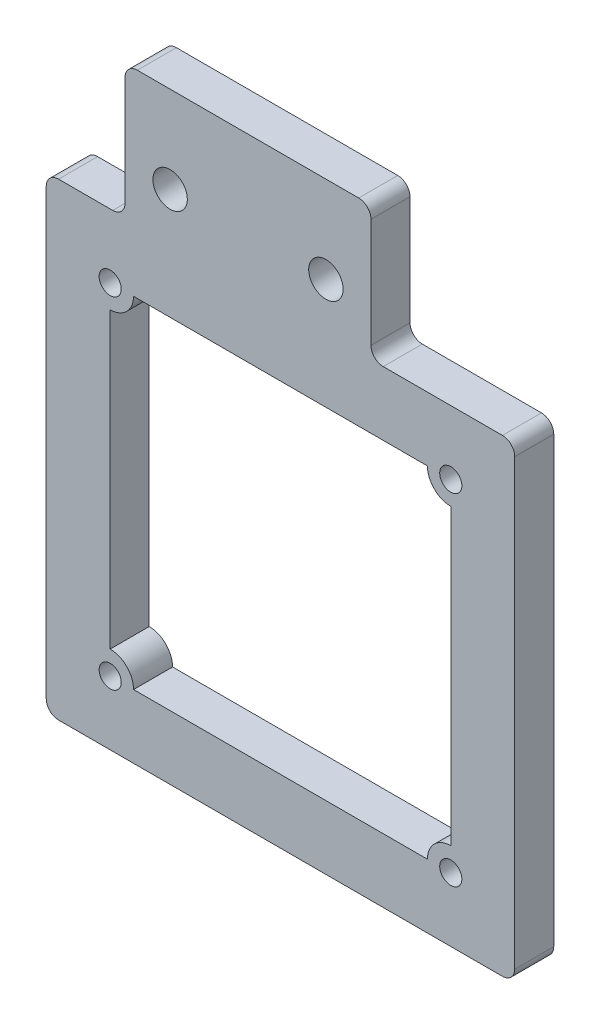
ISO-10303-21;
HEADER;
FILE_DESCRIPTION(('STEP AP214'),'2;1');
FILE_NAME('part.step','',(''),(''),'','','');
FILE_SCHEMA(('AUTOMOTIVE_DESIGN { 1 0 10303 214 1 1 1 1 }'));
ENDSEC;
DATA;
#1=APPLICATION_CONTEXT('core data for automotive mechanical design processes');
#2=APPLICATION_PROTOCOL_DEFINITION('international standard','automotive_design',2000,#1);
#3=PRODUCT_CONTEXT('',#1,'mechanical');
#4=PRODUCT('Part','Part','',(#3));
#5=PRODUCT_RELATED_PRODUCT_CATEGORY('part','',(#4));
#6=PRODUCT_DEFINITION_FORMATION('','',#4);
#7=PRODUCT_DEFINITION_CONTEXT('part definition',#1,'design');
#8=PRODUCT_DEFINITION('design','',#6,#7);
#9=PRODUCT_DEFINITION_SHAPE('','',#8);
#10=(LENGTH_UNIT() NAMED_UNIT(*) SI_UNIT(.MILLI.,.METRE.));
#11=(NAMED_UNIT(*) PLANE_ANGLE_UNIT() SI_UNIT($,.RADIAN.));
#12=(NAMED_UNIT(*) SI_UNIT($,.STERADIAN.) SOLID_ANGLE_UNIT());
#13=UNCERTAINTY_MEASURE_WITH_UNIT(LENGTH_MEASURE(1.E-05),#10,'distance_accuracy_value','');
#14=(GEOMETRIC_REPRESENTATION_CONTEXT(3) GLOBAL_UNCERTAINTY_ASSIGNED_CONTEXT((#13)) GLOBAL_UNIT_ASSIGNED_CONTEXT((#10,
#11,#12)) REPRESENTATION_CONTEXT('',''));
#15=CARTESIAN_POINT('',(0.,0.,0.));
#16=DIRECTION('',(0.,0.,1.));
#17=DIRECTION('',(1.,0.,0.));
#18=AXIS2_PLACEMENT_3D('',#15,#16,#17);
#19=CARTESIAN_POINT('',(0.,0.,3.175));
#20=DIRECTION('',(0.,0.,1.));
#21=DIRECTION('',(1.,0.,0.));
#22=AXIS2_PLACEMENT_3D('',#19,#20,#21);
#23=PLANE('',#22);
#24=CARTESIAN_POINT('',(-1.20910547078258,-5.19999999999999,3.175));
#25=DIRECTION('',(0.,0.,1.));
#26=DIRECTION('',(1.,0.,0.));
#27=AXIS2_PLACEMENT_3D('',#24,#25,#26);
#28=CIRCLE('',#27,0.9);
#29=CARTESIAN_POINT('',(-0.309105470782583,-5.19999999999999,3.175));
#30=VERTEX_POINT('',#29);
#31=EDGE_CURVE('E907',#30,#30,#28,.T.);
#32=ORIENTED_EDGE('',*,*,#31,.F.);
#33=EDGE_LOOP('',(#32));
#34=FACE_BOUND('',#33,.T.);
#35=CARTESIAN_POINT('',(3.66495523115076,3.81159322250824,3.175));
#36=DIRECTION('',(0.,0.,1.));
#37=DIRECTION('',(1.,0.,0.));
#38=AXIS2_PLACEMENT_3D('',#35,#36,#37);
#39=CIRCLE('',#38,1.4);
#40=CARTESIAN_POINT('',(5.06495523115076,3.81159322250824,3.175));
#41=VERTEX_POINT('',#40);
#42=EDGE_CURVE('E592',#41,#41,#39,.T.);
#43=ORIENTED_EDGE('',*,*,#42,.F.);
#44=EDGE_LOOP('',(#43));
#45=FACE_BOUND('',#44,.T.);
#46=CARTESIAN_POINT('',(-1.20910547078258,-32.9,3.175));
#47=DIRECTION('',(0.,0.,1.));
#48=DIRECTION('',(1.,0.,0.));
#49=AXIS2_PLACEMENT_3D('',#46,#47,#48);
#50=CIRCLE('',#49,0.899999999999999);
#51=CARTESIAN_POINT('',(-0.309105470782584,-32.9,3.175));
#52=VERTEX_POINT('',#51);
#53=EDGE_CURVE('E604',#52,#52,#50,.T.);
#54=ORIENTED_EDGE('',*,*,#53,.F.);
#55=EDGE_LOOP('',(#54));
#56=FACE_BOUND('',#55,.T.);
#57=DIRECTION('',(0.,-1.,0.));
#58=VECTOR('',#57,1.);
#59=CARTESIAN_POINT('',(20.,10.8755385296888,3.175));
#60=LINE('',#59,#58);
#61=CARTESIAN_POINT('',(20.,9.87553852968881,3.175));
#62=VERTEX_POINT('',#61);
#63=CARTESIAN_POINT('',(20.,1.,3.175));
#64=VERTEX_POINT('',#63);
#65=EDGE_CURVE('E630',#62,#64,#60,.T.);
#66=ORIENTED_EDGE('',*,*,#65,.F.);
#67=CARTESIAN_POINT('',(19.,9.87553852968881,3.175));
#68=DIRECTION('',(0.,0.,1.));
#69=DIRECTION('',(1.,0.,0.));
#70=AXIS2_PLACEMENT_3D('',#67,#68,#69);
#71=CIRCLE('',#70,1.);
#72=CARTESIAN_POINT('',(19.,10.8755385296888,3.175));
#73=VERTEX_POINT('',#72);
#74=EDGE_CURVE('E690',#62,#73,#71,.T.);
#75=ORIENTED_EDGE('',*,*,#74,.T.);
#76=DIRECTION('',(-1.,0.,0.));
#77=VECTOR('',#76,1.);
#78=CARTESIAN_POINT('',(20.,10.8755385296888,3.175));
#79=LINE('',#78,#77);
#80=CARTESIAN_POINT('',(1.,10.8755385296888,3.175));
#81=VERTEX_POINT('',#80);
#82=EDGE_CURVE('E610',#73,#81,#79,.T.);
#83=ORIENTED_EDGE('',*,*,#82,.T.);
#84=CARTESIAN_POINT('',(1.,9.87553852968881,3.175));
#85=DIRECTION('',(0.,0.,1.));
#86=DIRECTION('',(1.,0.,0.));
#87=AXIS2_PLACEMENT_3D('',#84,#85,#86);
#88=CIRCLE('',#87,1.);
#89=CARTESIAN_POINT('',(0.,9.87553852968881,3.175));
#90=VERTEX_POINT('',#89);
#91=EDGE_CURVE('E688',#81,#90,#88,.T.);
#92=ORIENTED_EDGE('',*,*,#91,.T.);
#93=DIRECTION('',(0.,-1.,0.));
#94=VECTOR('',#93,1.);
#95=CARTESIAN_POINT('',(0.,10.8755385296888,3.175));
#96=LINE('',#95,#94);
#97=CARTESIAN_POINT('',(0.,1.,3.175));
#98=VERTEX_POINT('',#97);
#99=EDGE_CURVE('E613',#90,#98,#96,.T.);
#100=ORIENTED_EDGE('',*,*,#99,.T.);
#101=CARTESIAN_POINT('',(-1.,1.,3.175));
#102=DIRECTION('',(0.,0.,1.));
#103=DIRECTION('',(1.,0.,0.));
#104=AXIS2_PLACEMENT_3D('',#101,#102,#103);
#105=CIRCLE('',#104,1.);
#106=CARTESIAN_POINT('',(-1.,0.,3.175));
#107=VERTEX_POINT('',#106);
#108=EDGE_CURVE('E12',#98,#107,#105,.F.);
#109=ORIENTED_EDGE('',*,*,#108,.T.);
#110=DIRECTION('',(-1.,0.,0.));
#111=VECTOR('',#110,1.);
#112=CARTESIAN_POINT('',(0.,0.,3.175));
#113=LINE('',#112,#111);
#114=CARTESIAN_POINT('',(-5.40910547078259,0.,3.175));
#115=VERTEX_POINT('',#114);
#116=EDGE_CURVE('E617',#107,#115,#113,.T.);
#117=ORIENTED_EDGE('',*,*,#116,.T.);
#118=CARTESIAN_POINT('',(-5.40910547078259,-0.999999999999994,3.175));
#119=DIRECTION('',(0.,0.,1.));
#120=DIRECTION('',(1.,0.,0.));
#121=AXIS2_PLACEMENT_3D('',#118,#119,#120);
#122=CIRCLE('',#121,1.);
#123=CARTESIAN_POINT('',(-6.40910547078259,-0.999999999999994,3.175));
#124=VERTEX_POINT('',#123);
#125=EDGE_CURVE('E686',#115,#124,#122,.T.);
#126=ORIENTED_EDGE('',*,*,#125,.T.);
#127=DIRECTION('',(0.,-1.,0.));
#128=VECTOR('',#127,1.);
#129=CARTESIAN_POINT('',(-6.40910547078259,0.,3.175));
#130=LINE('',#129,#128);
#131=CARTESIAN_POINT('',(-6.40910547078259,-37.1,3.175));
#132=VERTEX_POINT('',#131);
#133=EDGE_CURVE('E620',#124,#132,#130,.T.);
#134=ORIENTED_EDGE('',*,*,#133,.T.);
#135=CARTESIAN_POINT('',(-5.40910547078259,-37.1,3.175));
#136=DIRECTION('',(0.,0.,1.));
#137=DIRECTION('',(1.,0.,0.));
#138=AXIS2_PLACEMENT_3D('',#135,#136,#137);
#139=CIRCLE('',#138,1.);
#140=CARTESIAN_POINT('',(-5.40910547078259,-38.1,3.175));
#141=VERTEX_POINT('',#140);
#142=EDGE_CURVE('E684',#132,#141,#139,.T.);
#143=ORIENTED_EDGE('',*,*,#142,.T.);
#144=DIRECTION('',(1.,0.,0.));
#145=VECTOR('',#144,1.);
#146=CARTESIAN_POINT('',(-6.40910547078259,-38.1,3.175));
#147=LINE('',#146,#145);
#148=CARTESIAN_POINT('',(30.6908945292174,-38.1,3.175));
#149=VERTEX_POINT('',#148);
#150=EDGE_CURVE('E623',#141,#149,#147,.T.);
#151=ORIENTED_EDGE('',*,*,#150,.T.);
#152=CARTESIAN_POINT('',(30.6908945292174,-37.1,3.175));
#153=DIRECTION('',(0.,0.,1.));
#154=DIRECTION('',(1.,0.,0.));
#155=AXIS2_PLACEMENT_3D('',#152,#153,#154);
#156=CIRCLE('',#155,1.);
#157=CARTESIAN_POINT('',(31.6908945292174,-37.1,3.175));
#158=VERTEX_POINT('',#157);
#159=EDGE_CURVE('E374',#149,#158,#156,.T.);
#160=ORIENTED_EDGE('',*,*,#159,.T.);
#161=DIRECTION('',(0.,1.,0.));
#162=VECTOR('',#161,1.);
#163=CARTESIAN_POINT('',(31.6908945292174,-38.1,3.175));
#164=LINE('',#163,#162);
#165=CARTESIAN_POINT('',(31.6908945292174,-0.999999999999987,3.175));
#166=VERTEX_POINT('',#165);
#167=EDGE_CURVE('E625',#158,#166,#164,.T.);
#168=ORIENTED_EDGE('',*,*,#167,.T.);
#169=CARTESIAN_POINT('',(30.6908945292174,-0.99999999999999,3.175));
#170=DIRECTION('',(0.,0.,1.));
#171=DIRECTION('',(1.,0.,0.));
#172=AXIS2_PLACEMENT_3D('',#169,#170,#171);
#173=CIRCLE('',#172,1.);
#174=CARTESIAN_POINT('',(30.6908945292174,0.,3.175));
#175=VERTEX_POINT('',#174);
#176=EDGE_CURVE('E682',#166,#175,#173,.T.);
#177=ORIENTED_EDGE('',*,*,#176,.T.);
#178=DIRECTION('',(-1.,0.,0.));
#179=VECTOR('',#178,1.);
#180=CARTESIAN_POINT('',(31.6908945292174,0.,3.175));
#181=LINE('',#180,#179);
#182=CARTESIAN_POINT('',(21.,0.,3.175));
#183=VERTEX_POINT('',#182);
#184=EDGE_CURVE('E627',#175,#183,#181,.T.);
#185=ORIENTED_EDGE('',*,*,#184,.T.);
#186=CARTESIAN_POINT('',(21.,1.,3.175));
#187=DIRECTION('',(0.,0.,1.));
#188=DIRECTION('',(1.,0.,0.));
#189=AXIS2_PLACEMENT_3D('',#186,#187,#188);
#190=CIRCLE('',#189,1.);
#191=EDGE_CURVE('E718',#183,#64,#190,.F.);
#192=ORIENTED_EDGE('',*,*,#191,.T.);
#193=EDGE_LOOP('',(#66,#75,#83,#92,#100,#109,#117,#126,#134,#143,#151,#160,#168,#177,#185,#192));
#194=FACE_BOUND('',#193,.T.);
#195=CARTESIAN_POINT('',(26.4908945292174,-32.9,3.175));
#196=DIRECTION('',(0.,0.,1.));
#197=DIRECTION('',(1.,0.,0.));
#198=AXIS2_PLACEMENT_3D('',#195,#196,#197);
#199=CIRCLE('',#198,0.9);
#200=CARTESIAN_POINT('',(27.3908945292174,-32.9,3.175));
#201=VERTEX_POINT('',#200);
#202=EDGE_CURVE('E598',#201,#201,#199,.T.);
#203=ORIENTED_EDGE('',*,*,#202,.F.);
#204=EDGE_LOOP('',(#203));
#205=FACE_BOUND('',#204,.T.);
#206=CARTESIAN_POINT('',(-1.20910547078258,-5.19999999999999,3.175));
#207=DIRECTION('',(0.,0.,1.));
#208=DIRECTION('',(1.,0.,0.));
#209=AXIS2_PLACEMENT_3D('',#206,#207,#208);
#210=CIRCLE('',#209,1.9);
#211=CARTESIAN_POINT('',(-1.20910547078258,-7.09999999999999,3.175));
#212=VERTEX_POINT('',#211);
#213=CARTESIAN_POINT('',(0.690894529217419,-5.19999999999999,3.175));
#214=VERTEX_POINT('',#213);
#215=EDGE_CURVE('E526',#212,#214,#210,.T.);
#216=ORIENTED_EDGE('',*,*,#215,.T.);
#217=DIRECTION('',(-1.,0.,0.));
#218=VECTOR('',#217,1.);
#219=CARTESIAN_POINT('',(24.5908945292174,-5.19999999999998,3.175));
#220=LINE('',#219,#218);
#221=CARTESIAN_POINT('',(24.5908945292174,-5.19999999999998,3.175));
#222=VERTEX_POINT('',#221);
#223=EDGE_CURVE('E514',#222,#214,#220,.T.);
#224=ORIENTED_EDGE('',*,*,#223,.F.);
#225=CARTESIAN_POINT('',(26.4908945292174,-5.19999999999999,3.175));
#226=DIRECTION('',(0.,0.,-1.));
#227=DIRECTION('',(-1.,0.,0.));
#228=AXIS2_PLACEMENT_3D('',#225,#226,#227);
#229=CIRCLE('',#228,1.9);
#230=CARTESIAN_POINT('',(26.4908945292174,-7.09999999999999,3.175));
#231=VERTEX_POINT('',#230);
#232=EDGE_CURVE('E525',#231,#222,#229,.T.);
#233=ORIENTED_EDGE('',*,*,#232,.F.);
#234=DIRECTION('',(0.,-1.,0.));
#235=VECTOR('',#234,1.);
#236=CARTESIAN_POINT('',(26.4908945292174,-7.09999999999999,3.175));
#237=LINE('',#236,#235);
#238=CARTESIAN_POINT('',(26.4908945292174,-31.,3.175));
#239=VERTEX_POINT('',#238);
#240=EDGE_CURVE('E548',#231,#239,#237,.T.);
#241=ORIENTED_EDGE('',*,*,#240,.T.);
#242=CARTESIAN_POINT('',(26.4908945292174,-32.9,3.175));
#243=DIRECTION('',(0.,0.,1.));
#244=DIRECTION('',(1.,0.,0.));
#245=AXIS2_PLACEMENT_3D('',#242,#243,#244);
#246=CIRCLE('',#245,1.9);
#247=CARTESIAN_POINT('',(24.5908945292174,-32.9,3.175));
#248=VERTEX_POINT('',#247);
#249=EDGE_CURVE('E551',#239,#248,#246,.T.);
#250=ORIENTED_EDGE('',*,*,#249,.T.);
#251=DIRECTION('',(-1.,0.,0.));
#252=VECTOR('',#251,1.);
#253=CARTESIAN_POINT('',(24.5908945292174,-32.9,3.175));
#254=LINE('',#253,#252);
#255=CARTESIAN_POINT('',(0.690894529217417,-32.9,3.175));
#256=VERTEX_POINT('',#255);
#257=EDGE_CURVE('E554',#248,#256,#254,.T.);
#258=ORIENTED_EDGE('',*,*,#257,.T.);
#259=CARTESIAN_POINT('',(-1.20910547078258,-32.9,3.175));
#260=DIRECTION('',(0.,0.,1.));
#261=DIRECTION('',(1.,0.,0.));
#262=AXIS2_PLACEMENT_3D('',#259,#260,#261);
#263=CIRCLE('',#262,1.9);
#264=CARTESIAN_POINT('',(-1.20910547078258,-31.,3.175));
#265=VERTEX_POINT('',#264);
#266=EDGE_CURVE('E557',#256,#265,#263,.T.);
#267=ORIENTED_EDGE('',*,*,#266,.T.);
#268=DIRECTION('',(0.,-1.,0.));
#269=VECTOR('',#268,1.);
#270=CARTESIAN_POINT('',(-1.20910547078258,-7.09999999999999,3.175));
#271=LINE('',#270,#269);
#272=EDGE_CURVE('E534',#212,#265,#271,.T.);
#273=ORIENTED_EDGE('',*,*,#272,.F.);
#274=EDGE_LOOP('',(#216,#224,#233,#241,#250,#258,#267,#273));
#275=FACE_BOUND('',#274,.T.);
#276=CARTESIAN_POINT('',(26.4908945292174,-5.19999999999999,3.175));
#277=DIRECTION('',(0.,0.,1.));
#278=DIRECTION('',(1.,0.,0.));
#279=AXIS2_PLACEMENT_3D('',#276,#277,#278);
#280=CIRCLE('',#279,0.9);
#281=CARTESIAN_POINT('',(27.3908945292174,-5.19999999999999,3.175));
#282=VERTEX_POINT('',#281);
#283=EDGE_CURVE('E562',#282,#282,#280,.T.);
#284=ORIENTED_EDGE('',*,*,#283,.F.);
#285=EDGE_LOOP('',(#284));
#286=FACE_BOUND('',#285,.T.);
#287=CARTESIAN_POINT('',(16.3350447688493,3.81159322250824,3.175));
#288=DIRECTION('',(0.,0.,1.));
#289=DIRECTION('',(1.,0.,0.));
#290=AXIS2_PLACEMENT_3D('',#287,#288,#289);
#291=CIRCLE('',#290,1.4);
#292=CARTESIAN_POINT('',(17.7350447688493,3.81159322250824,3.175));
#293=VERTEX_POINT('',#292);
#294=EDGE_CURVE('E903',#293,#293,#291,.T.);
#295=ORIENTED_EDGE('',*,*,#294,.F.);
#296=EDGE_LOOP('',(#295));
#297=FACE_BOUND('',#296,.T.);
#298=ADVANCED_FACE('F352',(#34,#45,#56,#194,#205,#275,#286,#297),#23,.T.);
#299=CARTESIAN_POINT('',(0.,0.,0.));
#300=DIRECTION('',(0.,0.,1.));
#301=DIRECTION('',(1.,0.,0.));
#302=AXIS2_PLACEMENT_3D('',#299,#300,#301);
#303=PLANE('',#302);
#304=DIRECTION('',(-1.,0.,0.));
#305=VECTOR('',#304,1.);
#306=CARTESIAN_POINT('',(24.5908945292174,-5.19999999999998,0.));
#307=LINE('',#306,#305);
#308=CARTESIAN_POINT('',(24.5908945292174,-5.19999999999999,0.));
#309=VERTEX_POINT('',#308);
#310=CARTESIAN_POINT('',(0.690894529217419,-5.19999999999999,0.));
#311=VERTEX_POINT('',#310);
#312=EDGE_CURVE('E561',#309,#311,#307,.T.);
#313=ORIENTED_EDGE('',*,*,#312,.T.);
#314=CARTESIAN_POINT('',(-1.20910547078258,-5.19999999999999,0.));
#315=DIRECTION('',(0.,0.,1.));
#316=DIRECTION('',(1.,0.,0.));
#317=AXIS2_PLACEMENT_3D('',#314,#315,#316);
#318=CIRCLE('',#317,1.9);
#319=CARTESIAN_POINT('',(-1.20910547078258,-7.09999999999999,0.));
#320=VERTEX_POINT('',#319);
#321=EDGE_CURVE('E533',#320,#311,#318,.T.);
#322=ORIENTED_EDGE('',*,*,#321,.F.);
#323=DIRECTION('',(0.,-1.,0.));
#324=VECTOR('',#323,1.);
#325=CARTESIAN_POINT('',(-1.20910547078258,-7.09999999999999,0.));
#326=LINE('',#325,#324);
#327=CARTESIAN_POINT('',(-1.20910547078258,-31.,0.));
#328=VERTEX_POINT('',#327);
#329=EDGE_CURVE('E538',#320,#328,#326,.T.);
#330=ORIENTED_EDGE('',*,*,#329,.T.);
#331=CARTESIAN_POINT('',(-1.20910547078258,-32.9,0.));
#332=DIRECTION('',(0.,0.,1.));
#333=DIRECTION('',(1.,0.,0.));
#334=AXIS2_PLACEMENT_3D('',#331,#332,#333);
#335=CIRCLE('',#334,1.9);
#336=CARTESIAN_POINT('',(0.690894529217417,-32.9,0.));
#337=VERTEX_POINT('',#336);
#338=EDGE_CURVE('E541',#337,#328,#335,.T.);
#339=ORIENTED_EDGE('',*,*,#338,.F.);
#340=DIRECTION('',(-1.,0.,0.));
#341=VECTOR('',#340,1.);
#342=CARTESIAN_POINT('',(24.5908945292174,-32.9,0.));
#343=LINE('',#342,#341);
#344=CARTESIAN_POINT('',(24.5908945292174,-32.9,0.));
#345=VERTEX_POINT('',#344);
#346=EDGE_CURVE('E573',#345,#337,#343,.T.);
#347=ORIENTED_EDGE('',*,*,#346,.F.);
#348=CARTESIAN_POINT('',(26.4908945292174,-32.9,0.));
#349=DIRECTION('',(0.,0.,1.));
#350=DIRECTION('',(1.,0.,0.));
#351=AXIS2_PLACEMENT_3D('',#348,#349,#350);
#352=CIRCLE('',#351,1.9);
#353=CARTESIAN_POINT('',(26.4908945292174,-31.,0.));
#354=VERTEX_POINT('',#353);
#355=EDGE_CURVE('E570',#354,#345,#352,.T.);
#356=ORIENTED_EDGE('',*,*,#355,.F.);
#357=DIRECTION('',(0.,-1.,0.));
#358=VECTOR('',#357,1.);
#359=CARTESIAN_POINT('',(26.4908945292174,-7.09999999999999,0.));
#360=LINE('',#359,#358);
#361=CARTESIAN_POINT('',(26.4908945292174,-7.09999999999999,0.));
#362=VERTEX_POINT('',#361);
#363=EDGE_CURVE('E567',#362,#354,#360,.T.);
#364=ORIENTED_EDGE('',*,*,#363,.F.);
#365=CARTESIAN_POINT('',(26.4908945292174,-5.19999999999999,0.));
#366=DIRECTION('',(0.,0.,-1.));
#367=DIRECTION('',(-1.,0.,0.));
#368=AXIS2_PLACEMENT_3D('',#365,#366,#367);
#369=CIRCLE('',#368,1.9);
#370=EDGE_CURVE('E564',#362,#309,#369,.T.);
#371=ORIENTED_EDGE('',*,*,#370,.T.);
#372=EDGE_LOOP('',(#313,#322,#330,#339,#347,#356,#364,#371));
#373=FACE_BOUND('',#372,.T.);
#374=DIRECTION('',(-1.,0.,0.));
#375=VECTOR('',#374,1.);
#376=CARTESIAN_POINT('',(20.,10.8755385296888,0.));
#377=LINE('',#376,#375);
#378=CARTESIAN_POINT('',(19.,10.8755385296888,0.));
#379=VERTEX_POINT('',#378);
#380=CARTESIAN_POINT('',(1.,10.8755385296888,0.));
#381=VERTEX_POINT('',#380);
#382=EDGE_CURVE('E607',#379,#381,#377,.T.);
#383=ORIENTED_EDGE('',*,*,#382,.F.);
#384=CARTESIAN_POINT('',(19.,9.87553852968881,0.));
#385=DIRECTION('',(0.,0.,1.));
#386=DIRECTION('',(1.,0.,0.));
#387=AXIS2_PLACEMENT_3D('',#384,#385,#386);
#388=CIRCLE('',#387,1.);
#389=CARTESIAN_POINT('',(20.,9.87553852968881,0.));
#390=VERTEX_POINT('',#389);
#391=EDGE_CURVE('E679',#379,#390,#388,.F.);
#392=ORIENTED_EDGE('',*,*,#391,.T.);
#393=DIRECTION('',(0.,-1.,0.));
#394=VECTOR('',#393,1.);
#395=CARTESIAN_POINT('',(20.,10.8755385296888,0.));
#396=LINE('',#395,#394);
#397=CARTESIAN_POINT('',(20.,1.,0.));
#398=VERTEX_POINT('',#397);
#399=EDGE_CURVE('E614',#390,#398,#396,.T.);
#400=ORIENTED_EDGE('',*,*,#399,.T.);
#401=CARTESIAN_POINT('',(21.,1.,0.));
#402=DIRECTION('',(0.,0.,1.));
#403=DIRECTION('',(1.,0.,0.));
#404=AXIS2_PLACEMENT_3D('',#401,#402,#403);
#405=CIRCLE('',#404,1.);
#406=CARTESIAN_POINT('',(21.,0.,0.));
#407=VERTEX_POINT('',#406);
#408=EDGE_CURVE('E716',#398,#407,#405,.T.);
#409=ORIENTED_EDGE('',*,*,#408,.T.);
#410=DIRECTION('',(-1.,0.,0.));
#411=VECTOR('',#410,1.);
#412=CARTESIAN_POINT('',(31.6908945292174,0.,0.));
#413=LINE('',#412,#411);
#414=CARTESIAN_POINT('',(30.6908945292174,0.,0.));
#415=VERTEX_POINT('',#414);
#416=EDGE_CURVE('E650',#415,#407,#413,.T.);
#417=ORIENTED_EDGE('',*,*,#416,.F.);
#418=CARTESIAN_POINT('',(30.6908945292174,-0.99999999999999,0.));
#419=DIRECTION('',(0.,0.,1.));
#420=DIRECTION('',(1.,0.,0.));
#421=AXIS2_PLACEMENT_3D('',#418,#419,#420);
#422=CIRCLE('',#421,1.);
#423=CARTESIAN_POINT('',(31.6908945292174,-0.999999999999987,0.));
#424=VERTEX_POINT('',#423);
#425=EDGE_CURVE('E671',#415,#424,#422,.F.);
#426=ORIENTED_EDGE('',*,*,#425,.T.);
#427=DIRECTION('',(0.,1.,0.));
#428=VECTOR('',#427,1.);
#429=CARTESIAN_POINT('',(31.6908945292174,-38.1,0.));
#430=LINE('',#429,#428);
#431=CARTESIAN_POINT('',(31.6908945292174,-37.1,0.));
#432=VERTEX_POINT('',#431);
#433=EDGE_CURVE('E648',#432,#424,#430,.T.);
#434=ORIENTED_EDGE('',*,*,#433,.F.);
#435=CARTESIAN_POINT('',(30.6908945292174,-37.1,0.));
#436=DIRECTION('',(0.,0.,1.));
#437=DIRECTION('',(1.,0.,0.));
#438=AXIS2_PLACEMENT_3D('',#435,#436,#437);
#439=CIRCLE('',#438,1.);
#440=CARTESIAN_POINT('',(30.6908945292174,-38.1,0.));
#441=VERTEX_POINT('',#440);
#442=EDGE_CURVE('E669',#432,#441,#439,.F.);
#443=ORIENTED_EDGE('',*,*,#442,.T.);
#444=DIRECTION('',(1.,0.,0.));
#445=VECTOR('',#444,1.);
#446=CARTESIAN_POINT('',(-6.40910547078259,-38.1,0.));
#447=LINE('',#446,#445);
#448=CARTESIAN_POINT('',(-5.40910547078259,-38.1,0.));
#449=VERTEX_POINT('',#448);
#450=EDGE_CURVE('E645',#449,#441,#447,.T.);
#451=ORIENTED_EDGE('',*,*,#450,.F.);
#452=CARTESIAN_POINT('',(-5.40910547078259,-37.1,0.));
#453=DIRECTION('',(0.,0.,1.));
#454=DIRECTION('',(1.,0.,0.));
#455=AXIS2_PLACEMENT_3D('',#452,#453,#454);
#456=CIRCLE('',#455,1.);
#457=CARTESIAN_POINT('',(-6.40910547078259,-37.1,0.));
#458=VERTEX_POINT('',#457);
#459=EDGE_CURVE('E673',#449,#458,#456,.F.);
#460=ORIENTED_EDGE('',*,*,#459,.T.);
#461=DIRECTION('',(0.,-1.,0.));
#462=VECTOR('',#461,1.);
#463=CARTESIAN_POINT('',(-6.40910547078259,0.,0.));
#464=LINE('',#463,#462);
#465=CARTESIAN_POINT('',(-6.40910547078259,-0.999999999999994,0.));
#466=VERTEX_POINT('',#465);
#467=EDGE_CURVE('E642',#466,#458,#464,.T.);
#468=ORIENTED_EDGE('',*,*,#467,.F.);
#469=CARTESIAN_POINT('',(-5.40910547078259,-0.999999999999994,0.));
#470=DIRECTION('',(0.,0.,1.));
#471=DIRECTION('',(1.,0.,0.));
#472=AXIS2_PLACEMENT_3D('',#469,#470,#471);
#473=CIRCLE('',#472,1.);
#474=CARTESIAN_POINT('',(-5.40910547078259,0.,0.));
#475=VERTEX_POINT('',#474);
#476=EDGE_CURVE('E675',#466,#475,#473,.F.);
#477=ORIENTED_EDGE('',*,*,#476,.T.);
#478=DIRECTION('',(-1.,0.,0.));
#479=VECTOR('',#478,1.);
#480=CARTESIAN_POINT('',(0.,0.,0.));
#481=LINE('',#480,#479);
#482=CARTESIAN_POINT('',(-1.,0.,0.));
#483=VERTEX_POINT('',#482);
#484=EDGE_CURVE('E639',#483,#475,#481,.T.);
#485=ORIENTED_EDGE('',*,*,#484,.F.);
#486=CARTESIAN_POINT('',(-1.,1.,0.));
#487=DIRECTION('',(0.,0.,1.));
#488=DIRECTION('',(1.,0.,0.));
#489=AXIS2_PLACEMENT_3D('',#486,#487,#488);
#490=CIRCLE('',#489,1.);
#491=CARTESIAN_POINT('',(0.,1.,0.));
#492=VERTEX_POINT('',#491);
#493=EDGE_CURVE('E360',#483,#492,#490,.T.);
#494=ORIENTED_EDGE('',*,*,#493,.T.);
#495=DIRECTION('',(0.,-1.,0.));
#496=VECTOR('',#495,1.);
#497=CARTESIAN_POINT('',(0.,10.8755385296888,0.));
#498=LINE('',#497,#496);
#499=CARTESIAN_POINT('',(0.,9.87553852968881,0.));
#500=VERTEX_POINT('',#499);
#501=EDGE_CURVE('E636',#500,#492,#498,.T.);
#502=ORIENTED_EDGE('',*,*,#501,.F.);
#503=CARTESIAN_POINT('',(1.,9.87553852968881,0.));
#504=DIRECTION('',(0.,0.,1.));
#505=DIRECTION('',(1.,0.,0.));
#506=AXIS2_PLACEMENT_3D('',#503,#504,#505);
#507=CIRCLE('',#506,1.);
#508=EDGE_CURVE('E677',#500,#381,#507,.F.);
#509=ORIENTED_EDGE('',*,*,#508,.T.);
#510=EDGE_LOOP('',(#383,#392,#400,#409,#417,#426,#434,#443,#451,#460,#468,#477,#485,#494,#502,#509));
#511=FACE_BOUND('',#510,.T.);
#512=CARTESIAN_POINT('',(-1.20910547078258,-32.9,0.));
#513=DIRECTION('',(0.,0.,1.));
#514=DIRECTION('',(1.,0.,0.));
#515=AXIS2_PLACEMENT_3D('',#512,#513,#514);
#516=CIRCLE('',#515,0.899999999999999);
#517=CARTESIAN_POINT('',(-0.309105470782584,-32.9,0.));
#518=VERTEX_POINT('',#517);
#519=EDGE_CURVE('E601',#518,#518,#516,.T.);
#520=ORIENTED_EDGE('',*,*,#519,.T.);
#521=EDGE_LOOP('',(#520));
#522=FACE_BOUND('',#521,.T.);
#523=CARTESIAN_POINT('',(26.4908945292174,-32.9,0.));
#524=DIRECTION('',(0.,0.,1.));
#525=DIRECTION('',(1.,0.,0.));
#526=AXIS2_PLACEMENT_3D('',#523,#524,#525);
#527=CIRCLE('',#526,0.9);
#528=CARTESIAN_POINT('',(27.3908945292174,-32.9,0.));
#529=VERTEX_POINT('',#528);
#530=EDGE_CURVE('E595',#529,#529,#527,.T.);
#531=ORIENTED_EDGE('',*,*,#530,.T.);
#532=EDGE_LOOP('',(#531));
#533=FACE_BOUND('',#532,.T.);
#534=CARTESIAN_POINT('',(3.66495523115076,3.81159322250824,0.));
#535=DIRECTION('',(0.,0.,1.));
#536=DIRECTION('',(1.,0.,0.));
#537=AXIS2_PLACEMENT_3D('',#534,#535,#536);
#538=CIRCLE('',#537,1.4);
#539=CARTESIAN_POINT('',(5.06495523115076,3.81159322250824,0.));
#540=VERTEX_POINT('',#539);
#541=EDGE_CURVE('E580',#540,#540,#538,.T.);
#542=ORIENTED_EDGE('',*,*,#541,.T.);
#543=EDGE_LOOP('',(#542));
#544=FACE_BOUND('',#543,.T.);
#545=CARTESIAN_POINT('',(26.4908945292174,-5.19999999999999,0.));
#546=DIRECTION('',(0.,0.,1.));
#547=DIRECTION('',(1.,0.,0.));
#548=AXIS2_PLACEMENT_3D('',#545,#546,#547);
#549=CIRCLE('',#548,0.9);
#550=CARTESIAN_POINT('',(27.3908945292174,-5.19999999999999,0.));
#551=VERTEX_POINT('',#550);
#552=EDGE_CURVE('E544',#551,#551,#549,.T.);
#553=ORIENTED_EDGE('',*,*,#552,.T.);
#554=EDGE_LOOP('',(#553));
#555=FACE_BOUND('',#554,.T.);
#556=CARTESIAN_POINT('',(-1.20910547078258,-5.19999999999999,0.));
#557=DIRECTION('',(0.,0.,1.));
#558=DIRECTION('',(1.,0.,0.));
#559=AXIS2_PLACEMENT_3D('',#556,#557,#558);
#560=CIRCLE('',#559,0.9);
#561=CARTESIAN_POINT('',(-0.309105470782583,-5.19999999999999,0.));
#562=VERTEX_POINT('',#561);
#563=EDGE_CURVE('E899',#562,#562,#560,.T.);
#564=ORIENTED_EDGE('',*,*,#563,.T.);
#565=EDGE_LOOP('',(#564));
#566=FACE_BOUND('',#565,.T.);
#567=CARTESIAN_POINT('',(16.3350447688493,3.81159322250824,0.));
#568=DIRECTION('',(0.,0.,1.));
#569=DIRECTION('',(1.,0.,0.));
#570=AXIS2_PLACEMENT_3D('',#567,#568,#569);
#571=CIRCLE('',#570,1.4);
#572=CARTESIAN_POINT('',(17.7350447688493,3.81159322250824,0.));
#573=VERTEX_POINT('',#572);
#574=EDGE_CURVE('E902',#573,#573,#571,.T.);
#575=ORIENTED_EDGE('',*,*,#574,.T.);
#576=EDGE_LOOP('',(#575));
#577=FACE_BOUND('',#576,.T.);
#578=ADVANCED_FACE('F723',(#373,#511,#522,#533,#544,#555,#566,#577),#303,.F.);
#579=CARTESIAN_POINT('',(20.,10.8755385296888,3.175));
#580=DIRECTION('',(0.,-1.,0.));
#581=DIRECTION('',(0.,0.,-1.));
#582=AXIS2_PLACEMENT_3D('',#579,#580,#581);
#583=PLANE('',#582);
#584=ORIENTED_EDGE('',*,*,#82,.F.);
#585=DIRECTION('',(0.,0.,-1.));
#586=VECTOR('',#585,1.);
#587=CARTESIAN_POINT('',(19.,10.8755385296888,0.));
#588=LINE('',#587,#586);
#589=EDGE_CURVE('E666',#73,#379,#588,.T.);
#590=ORIENTED_EDGE('',*,*,#589,.T.);
#591=ORIENTED_EDGE('',*,*,#382,.T.);
#592=DIRECTION('',(0.,0.,-1.));
#593=VECTOR('',#592,1.);
#594=CARTESIAN_POINT('',(1.,10.8755385296888,3.175));
#595=LINE('',#594,#593);
#596=EDGE_CURVE('E664',#381,#81,#595,.F.);
#597=ORIENTED_EDGE('',*,*,#596,.T.);
#598=EDGE_LOOP('',(#584,#590,#591,#597));
#599=FACE_BOUND('',#598,.T.);
#600=ADVANCED_FACE('F785',(#599),#583,.F.);
#601=CARTESIAN_POINT('',(0.,10.8755385296888,3.175));
#602=DIRECTION('',(1.,0.,0.));
#603=DIRECTION('',(0.,1.,0.));
#604=AXIS2_PLACEMENT_3D('',#601,#602,#603);
#605=PLANE('',#604);
#606=ORIENTED_EDGE('',*,*,#99,.F.);
#607=DIRECTION('',(0.,0.,-1.));
#608=VECTOR('',#607,1.);
#609=CARTESIAN_POINT('',(0.,9.87553852968881,3.175));
#610=LINE('',#609,#608);
#611=EDGE_CURVE('E694',#90,#500,#610,.T.);
#612=ORIENTED_EDGE('',*,*,#611,.T.);
#613=ORIENTED_EDGE('',*,*,#501,.T.);
#614=DIRECTION('',(0.,0.,-1.));
#615=VECTOR('',#614,1.);
#616=CARTESIAN_POINT('',(0.,1.,3.175));
#617=LINE('',#616,#615);
#618=EDGE_CURVE('E692',#492,#98,#617,.F.);
#619=ORIENTED_EDGE('',*,*,#618,.T.);
#620=EDGE_LOOP('',(#606,#612,#613,#619));
#621=FACE_BOUND('',#620,.T.);
#622=ADVANCED_FACE('F730',(#621),#605,.F.);
#623=CARTESIAN_POINT('',(0.,0.,3.175));
#624=DIRECTION('',(0.,-1.,0.));
#625=DIRECTION('',(1.,0.,0.));
#626=AXIS2_PLACEMENT_3D('',#623,#624,#625);
#627=PLANE('',#626);
#628=ORIENTED_EDGE('',*,*,#116,.F.);
#629=DIRECTION('',(0.,0.,-1.));
#630=VECTOR('',#629,1.);
#631=CARTESIAN_POINT('',(-1.,0.,0.));
#632=LINE('',#631,#630);
#633=EDGE_CURVE('E699',#107,#483,#632,.T.);
#634=ORIENTED_EDGE('',*,*,#633,.T.);
#635=ORIENTED_EDGE('',*,*,#484,.T.);
#636=DIRECTION('',(0.,0.,-1.));
#637=VECTOR('',#636,1.);
#638=CARTESIAN_POINT('',(-5.40910547078259,0.,3.175));
#639=LINE('',#638,#637);
#640=EDGE_CURVE('E697',#475,#115,#639,.F.);
#641=ORIENTED_EDGE('',*,*,#640,.T.);
#642=EDGE_LOOP('',(#628,#634,#635,#641));
#643=FACE_BOUND('',#642,.T.);
#644=ADVANCED_FACE('F739',(#643),#627,.F.);
#645=CARTESIAN_POINT('',(-6.40910547078259,0.,3.175));
#646=DIRECTION('',(1.,0.,0.));
#647=DIRECTION('',(0.,0.,-1.));
#648=AXIS2_PLACEMENT_3D('',#645,#646,#647);
#649=PLANE('',#648);
#650=ORIENTED_EDGE('',*,*,#133,.F.);
#651=DIRECTION('',(0.,0.,-1.));
#652=VECTOR('',#651,1.);
#653=CARTESIAN_POINT('',(-6.40910547078259,-0.999999999999994,3.175));
#654=LINE('',#653,#652);
#655=EDGE_CURVE('E704',#124,#466,#654,.T.);
#656=ORIENTED_EDGE('',*,*,#655,.T.);
#657=ORIENTED_EDGE('',*,*,#467,.T.);
#658=DIRECTION('',(0.,0.,-1.));
#659=VECTOR('',#658,1.);
#660=CARTESIAN_POINT('',(-6.40910547078259,-37.1,3.175));
#661=LINE('',#660,#659);
#662=EDGE_CURVE('E702',#458,#132,#661,.F.);
#663=ORIENTED_EDGE('',*,*,#662,.T.);
#664=EDGE_LOOP('',(#650,#656,#657,#663));
#665=FACE_BOUND('',#664,.T.);
#666=ADVANCED_FACE('F747',(#665),#649,.F.);
#667=CARTESIAN_POINT('',(-6.40910547078259,-38.1,3.175));
#668=DIRECTION('',(0.,1.,0.));
#669=DIRECTION('',(0.,0.,1.));
#670=AXIS2_PLACEMENT_3D('',#667,#668,#669);
#671=PLANE('',#670);
#672=ORIENTED_EDGE('',*,*,#150,.F.);
#673=DIRECTION('',(0.,0.,-1.));
#674=VECTOR('',#673,1.);
#675=CARTESIAN_POINT('',(-5.40910547078259,-38.1,3.175));
#676=LINE('',#675,#674);
#677=EDGE_CURVE('E709',#141,#449,#676,.T.);
#678=ORIENTED_EDGE('',*,*,#677,.T.);
#679=ORIENTED_EDGE('',*,*,#450,.T.);
#680=DIRECTION('',(0.,0.,-1.));
#681=VECTOR('',#680,1.);
#682=CARTESIAN_POINT('',(30.6908945292174,-38.1,3.175));
#683=LINE('',#682,#681);
#684=EDGE_CURVE('E707',#441,#149,#683,.F.);
#685=ORIENTED_EDGE('',*,*,#684,.T.);
#686=EDGE_LOOP('',(#672,#678,#679,#685));
#687=FACE_BOUND('',#686,.T.);
#688=ADVANCED_FACE('F755',(#687),#671,.F.);
#689=CARTESIAN_POINT('',(31.6908945292174,-38.1,3.175));
#690=DIRECTION('',(-1.,0.,0.));
#691=DIRECTION('',(0.,0.,1.));
#692=AXIS2_PLACEMENT_3D('',#689,#690,#691);
#693=PLANE('',#692);
#694=ORIENTED_EDGE('',*,*,#433,.T.);
#695=DIRECTION('',(0.,0.,-1.));
#696=VECTOR('',#695,1.);
#697=CARTESIAN_POINT('',(31.6908945292174,-0.999999999999987,3.175));
#698=LINE('',#697,#696);
#699=EDGE_CURVE('E367',#424,#166,#698,.F.);
#700=ORIENTED_EDGE('',*,*,#699,.T.);
#701=ORIENTED_EDGE('',*,*,#167,.F.);
#702=DIRECTION('',(0.,0.,-1.));
#703=VECTOR('',#702,1.);
#704=CARTESIAN_POINT('',(31.6908945292174,-37.1,3.175));
#705=LINE('',#704,#703);
#706=EDGE_CURVE('E712',#158,#432,#705,.T.);
#707=ORIENTED_EDGE('',*,*,#706,.T.);
#708=EDGE_LOOP('',(#694,#700,#701,#707));
#709=FACE_BOUND('',#708,.T.);
#710=ADVANCED_FACE('F761',(#709),#693,.F.);
#711=CARTESIAN_POINT('',(31.6908945292174,0.,3.175));
#712=DIRECTION('',(0.,-1.,0.));
#713=DIRECTION('',(1.,0.,0.));
#714=AXIS2_PLACEMENT_3D('',#711,#712,#713);
#715=PLANE('',#714);
#716=ORIENTED_EDGE('',*,*,#416,.T.);
#717=DIRECTION('',(0.,0.,-1.));
#718=VECTOR('',#717,1.);
#719=CARTESIAN_POINT('',(21.,0.,3.175));
#720=LINE('',#719,#718);
#721=EDGE_CURVE('E662',#407,#183,#720,.F.);
#722=ORIENTED_EDGE('',*,*,#721,.T.);
#723=ORIENTED_EDGE('',*,*,#184,.F.);
#724=DIRECTION('',(0.,0.,-1.));
#725=VECTOR('',#724,1.);
#726=CARTESIAN_POINT('',(30.6908945292174,0.,3.175));
#727=LINE('',#726,#725);
#728=EDGE_CURVE('E659',#175,#415,#727,.T.);
#729=ORIENTED_EDGE('',*,*,#728,.T.);
#730=EDGE_LOOP('',(#716,#722,#723,#729));
#731=FACE_BOUND('',#730,.T.);
#732=ADVANCED_FACE('F769',(#731),#715,.F.);
#733=CARTESIAN_POINT('',(20.,10.8755385296888,3.175));
#734=DIRECTION('',(1.,0.,0.));
#735=DIRECTION('',(0.,0.,-1.));
#736=AXIS2_PLACEMENT_3D('',#733,#734,#735);
#737=PLANE('',#736);
#738=ORIENTED_EDGE('',*,*,#65,.T.);
#739=DIRECTION('',(0.,0.,-1.));
#740=VECTOR('',#739,1.);
#741=CARTESIAN_POINT('',(20.,1.,3.175));
#742=LINE('',#741,#740);
#743=EDGE_CURVE('E656',#64,#398,#742,.T.);
#744=ORIENTED_EDGE('',*,*,#743,.T.);
#745=ORIENTED_EDGE('',*,*,#399,.F.);
#746=DIRECTION('',(0.,0.,-1.));
#747=VECTOR('',#746,1.);
#748=CARTESIAN_POINT('',(20.,9.87553852968881,3.175));
#749=LINE('',#748,#747);
#750=EDGE_CURVE('E633',#390,#62,#749,.F.);
#751=ORIENTED_EDGE('',*,*,#750,.T.);
#752=EDGE_LOOP('',(#738,#744,#745,#751));
#753=FACE_BOUND('',#752,.T.);
#754=ADVANCED_FACE('F777',(#753),#737,.T.);
#755=CARTESIAN_POINT('',(-1.20910547078258,-32.9,3.175));
#756=DIRECTION('',(0.,0.,-1.));
#757=DIRECTION('',(-1.,0.,0.));
#758=AXIS2_PLACEMENT_3D('',#755,#756,#757);
#759=CYLINDRICAL_SURFACE('',#758,0.899999999999999);
#760=ORIENTED_EDGE('',*,*,#53,.T.);
#761=EDGE_LOOP('',(#760));
#762=FACE_BOUND('',#761,.T.);
#763=ORIENTED_EDGE('',*,*,#519,.F.);
#764=EDGE_LOOP('',(#763));
#765=FACE_BOUND('',#764,.T.);
#766=ADVANCED_FACE('F809',(#762,#765),#759,.F.);
#767=CARTESIAN_POINT('',(26.4908945292174,-32.9,3.175));
#768=DIRECTION('',(0.,0.,-1.));
#769=DIRECTION('',(-1.,0.,0.));
#770=AXIS2_PLACEMENT_3D('',#767,#768,#769);
#771=CYLINDRICAL_SURFACE('',#770,0.9);
#772=ORIENTED_EDGE('',*,*,#202,.T.);
#773=EDGE_LOOP('',(#772));
#774=FACE_BOUND('',#773,.T.);
#775=ORIENTED_EDGE('',*,*,#530,.F.);
#776=EDGE_LOOP('',(#775));
#777=FACE_BOUND('',#776,.T.);
#778=ADVANCED_FACE('F878',(#774,#777),#771,.F.);
#779=CARTESIAN_POINT('',(3.66495523115076,3.81159322250824,3.175));
#780=DIRECTION('',(0.,0.,-1.));
#781=DIRECTION('',(-1.,0.,0.));
#782=AXIS2_PLACEMENT_3D('',#779,#780,#781);
#783=CYLINDRICAL_SURFACE('',#782,1.4);
#784=ORIENTED_EDGE('',*,*,#42,.T.);
#785=EDGE_LOOP('',(#784));
#786=FACE_BOUND('',#785,.T.);
#787=ORIENTED_EDGE('',*,*,#541,.F.);
#788=EDGE_LOOP('',(#787));
#789=FACE_BOUND('',#788,.T.);
#790=ADVANCED_FACE('F876',(#786,#789),#783,.F.);
#791=CARTESIAN_POINT('',(-1.20910547078258,-5.19999999999999,3.175));
#792=DIRECTION('',(0.,0.,-1.));
#793=DIRECTION('',(-1.,0.,0.));
#794=AXIS2_PLACEMENT_3D('',#791,#792,#793);
#795=CYLINDRICAL_SURFACE('',#794,1.9);
#796=ORIENTED_EDGE('',*,*,#321,.T.);
#797=DIRECTION('',(0.,0.,-1.));
#798=VECTOR('',#797,1.);
#799=CARTESIAN_POINT('',(0.690894529217419,-5.19999999999999,3.175));
#800=LINE('',#799,#798);
#801=EDGE_CURVE('E518',#214,#311,#800,.T.);
#802=ORIENTED_EDGE('',*,*,#801,.F.);
#803=ORIENTED_EDGE('',*,*,#215,.F.);
#804=DIRECTION('',(0.,0.,-1.));
#805=VECTOR('',#804,1.);
#806=CARTESIAN_POINT('',(-1.20910547078258,-7.09999999999999,3.175));
#807=LINE('',#806,#805);
#808=EDGE_CURVE('E578',#212,#320,#807,.T.);
#809=ORIENTED_EDGE('',*,*,#808,.T.);
#810=EDGE_LOOP('',(#796,#802,#803,#809));
#811=FACE_BOUND('',#810,.T.);
#812=ADVANCED_FACE('F530',(#811),#795,.T.);
#813=CARTESIAN_POINT('',(-1.20910547078258,-7.09999999999999,3.175));
#814=DIRECTION('',(1.,0.,0.));
#815=DIRECTION('',(0.,1.,0.));
#816=AXIS2_PLACEMENT_3D('',#813,#814,#815);
#817=PLANE('',#816);
#818=ORIENTED_EDGE('',*,*,#329,.F.);
#819=ORIENTED_EDGE('',*,*,#808,.F.);
#820=ORIENTED_EDGE('',*,*,#272,.T.);
#821=DIRECTION('',(0.,0.,-1.));
#822=VECTOR('',#821,1.);
#823=CARTESIAN_POINT('',(-1.20910547078258,-31.,3.175));
#824=LINE('',#823,#822);
#825=EDGE_CURVE('E581',#265,#328,#824,.T.);
#826=ORIENTED_EDGE('',*,*,#825,.T.);
#827=EDGE_LOOP('',(#818,#819,#820,#826));
#828=FACE_BOUND('',#827,.T.);
#829=ADVANCED_FACE('F848',(#828),#817,.T.);
#830=CARTESIAN_POINT('',(-1.20910547078258,-32.9,3.175));
#831=DIRECTION('',(0.,0.,-1.));
#832=DIRECTION('',(-1.,0.,0.));
#833=AXIS2_PLACEMENT_3D('',#830,#831,#832);
#834=CYLINDRICAL_SURFACE('',#833,1.9);
#835=ORIENTED_EDGE('',*,*,#338,.T.);
#836=ORIENTED_EDGE('',*,*,#825,.F.);
#837=ORIENTED_EDGE('',*,*,#266,.F.);
#838=DIRECTION('',(0.,0.,-1.));
#839=VECTOR('',#838,1.);
#840=CARTESIAN_POINT('',(0.690894529217417,-32.9,3.175));
#841=LINE('',#840,#839);
#842=EDGE_CURVE('E583',#256,#337,#841,.T.);
#843=ORIENTED_EDGE('',*,*,#842,.T.);
#844=EDGE_LOOP('',(#835,#836,#837,#843));
#845=FACE_BOUND('',#844,.T.);
#846=ADVANCED_FACE('F851',(#845),#834,.T.);
#847=CARTESIAN_POINT('',(24.5908945292174,-32.9,3.175));
#848=DIRECTION('',(0.,-1.,0.));
#849=DIRECTION('',(0.,0.,-1.));
#850=AXIS2_PLACEMENT_3D('',#847,#848,#849);
#851=PLANE('',#850);
#852=ORIENTED_EDGE('',*,*,#346,.T.);
#853=ORIENTED_EDGE('',*,*,#842,.F.);
#854=ORIENTED_EDGE('',*,*,#257,.F.);
#855=DIRECTION('',(0.,0.,-1.));
#856=VECTOR('',#855,1.);
#857=CARTESIAN_POINT('',(24.5908945292174,-32.9,3.175));
#858=LINE('',#857,#856);
#859=EDGE_CURVE('E585',#248,#345,#858,.T.);
#860=ORIENTED_EDGE('',*,*,#859,.T.);
#861=EDGE_LOOP('',(#852,#853,#854,#860));
#862=FACE_BOUND('',#861,.T.);
#863=ADVANCED_FACE('F855',(#862),#851,.F.);
#864=CARTESIAN_POINT('',(26.4908945292174,-32.9,3.175));
#865=DIRECTION('',(0.,0.,-1.));
#866=DIRECTION('',(-1.,0.,0.));
#867=AXIS2_PLACEMENT_3D('',#864,#865,#866);
#868=CYLINDRICAL_SURFACE('',#867,1.9);
#869=ORIENTED_EDGE('',*,*,#355,.T.);
#870=ORIENTED_EDGE('',*,*,#859,.F.);
#871=ORIENTED_EDGE('',*,*,#249,.F.);
#872=DIRECTION('',(0.,0.,-1.));
#873=VECTOR('',#872,1.);
#874=CARTESIAN_POINT('',(26.4908945292174,-31.,3.175));
#875=LINE('',#874,#873);
#876=EDGE_CURVE('E587',#239,#354,#875,.T.);
#877=ORIENTED_EDGE('',*,*,#876,.T.);
#878=EDGE_LOOP('',(#869,#870,#871,#877));
#879=FACE_BOUND('',#878,.T.);
#880=ADVANCED_FACE('F859',(#879),#868,.T.);
#881=CARTESIAN_POINT('',(26.4908945292174,-7.09999999999999,3.175));
#882=DIRECTION('',(1.,0.,0.));
#883=DIRECTION('',(0.,1.,0.));
#884=AXIS2_PLACEMENT_3D('',#881,#882,#883);
#885=PLANE('',#884);
#886=ORIENTED_EDGE('',*,*,#363,.T.);
#887=ORIENTED_EDGE('',*,*,#876,.F.);
#888=ORIENTED_EDGE('',*,*,#240,.F.);
#889=DIRECTION('',(0.,0.,-1.));
#890=VECTOR('',#889,1.);
#891=CARTESIAN_POINT('',(26.4908945292174,-7.09999999999999,3.175));
#892=LINE('',#891,#890);
#893=EDGE_CURVE('E589',#231,#362,#892,.T.);
#894=ORIENTED_EDGE('',*,*,#893,.T.);
#895=EDGE_LOOP('',(#886,#887,#888,#894));
#896=FACE_BOUND('',#895,.T.);
#897=ADVANCED_FACE('F863',(#896),#885,.F.);
#898=CARTESIAN_POINT('',(26.4908945292174,-5.19999999999999,3.175));
#899=DIRECTION('',(0.,0.,-1.));
#900=DIRECTION('',(-1.,0.,0.));
#901=AXIS2_PLACEMENT_3D('',#898,#899,#900);
#902=CYLINDRICAL_SURFACE('',#901,1.9);
#903=ORIENTED_EDGE('',*,*,#370,.F.);
#904=ORIENTED_EDGE('',*,*,#893,.F.);
#905=ORIENTED_EDGE('',*,*,#232,.T.);
#906=DIRECTION('',(0.,0.,-1.));
#907=VECTOR('',#906,1.);
#908=CARTESIAN_POINT('',(24.5908945292174,-5.19999999999999,3.175));
#909=LINE('',#908,#907);
#910=EDGE_CURVE('E520',#222,#309,#909,.T.);
#911=ORIENTED_EDGE('',*,*,#910,.T.);
#912=EDGE_LOOP('',(#903,#904,#905,#911));
#913=FACE_BOUND('',#912,.T.);
#914=ADVANCED_FACE('F867',(#913),#902,.T.);
#915=CARTESIAN_POINT('',(24.5908945292174,-5.19999999999998,3.175));
#916=DIRECTION('',(0.,-1.,0.));
#917=DIRECTION('',(1.,0.,0.));
#918=AXIS2_PLACEMENT_3D('',#915,#916,#917);
#919=PLANE('',#918);
#920=ORIENTED_EDGE('',*,*,#312,.F.);
#921=ORIENTED_EDGE('',*,*,#910,.F.);
#922=ORIENTED_EDGE('',*,*,#223,.T.);
#923=ORIENTED_EDGE('',*,*,#801,.T.);
#924=EDGE_LOOP('',(#920,#921,#922,#923));
#925=FACE_BOUND('',#924,.T.);
#926=ADVANCED_FACE('F517',(#925),#919,.T.);
#927=CARTESIAN_POINT('',(26.4908945292174,-5.19999999999999,3.175));
#928=DIRECTION('',(0.,0.,-1.));
#929=DIRECTION('',(-1.,0.,0.));
#930=AXIS2_PLACEMENT_3D('',#927,#928,#929);
#931=CYLINDRICAL_SURFACE('',#930,0.9);
#932=ORIENTED_EDGE('',*,*,#283,.T.);
#933=EDGE_LOOP('',(#932));
#934=FACE_BOUND('',#933,.T.);
#935=ORIENTED_EDGE('',*,*,#552,.F.);
#936=EDGE_LOOP('',(#935));
#937=FACE_BOUND('',#936,.T.);
#938=ADVANCED_FACE('F839',(#934,#937),#931,.F.);
#939=CARTESIAN_POINT('',(-1.20910547078258,-5.19999999999999,3.175));
#940=DIRECTION('',(0.,0.,-1.));
#941=DIRECTION('',(-1.,0.,0.));
#942=AXIS2_PLACEMENT_3D('',#939,#940,#941);
#943=CYLINDRICAL_SURFACE('',#942,0.9);
#944=ORIENTED_EDGE('',*,*,#31,.T.);
#945=EDGE_LOOP('',(#944));
#946=FACE_BOUND('',#945,.T.);
#947=ORIENTED_EDGE('',*,*,#563,.F.);
#948=EDGE_LOOP('',(#947));
#949=FACE_BOUND('',#948,.T.);
#950=ADVANCED_FACE('F833',(#946,#949),#943,.F.);
#951=CARTESIAN_POINT('',(16.3350447688493,3.81159322250824,3.175));
#952=DIRECTION('',(0.,0.,-1.));
#953=DIRECTION('',(-1.,0.,0.));
#954=AXIS2_PLACEMENT_3D('',#951,#952,#953);
#955=CYLINDRICAL_SURFACE('',#954,1.4);
#956=ORIENTED_EDGE('',*,*,#294,.T.);
#957=EDGE_LOOP('',(#956));
#958=FACE_BOUND('',#957,.T.);
#959=ORIENTED_EDGE('',*,*,#574,.F.);
#960=EDGE_LOOP('',(#959));
#961=FACE_BOUND('',#960,.T.);
#962=ADVANCED_FACE('F829',(#958,#961),#955,.F.);
#963=CARTESIAN_POINT('',(21.,1.,3.175));
#964=DIRECTION('',(0.,0.,-1.));
#965=DIRECTION('',(-1.,0.,0.));
#966=AXIS2_PLACEMENT_3D('',#963,#964,#965);
#967=CYLINDRICAL_SURFACE('',#966,1.);
#968=ORIENTED_EDGE('',*,*,#191,.F.);
#969=ORIENTED_EDGE('',*,*,#721,.F.);
#970=ORIENTED_EDGE('',*,*,#408,.F.);
#971=ORIENTED_EDGE('',*,*,#743,.F.);
#972=EDGE_LOOP('',(#968,#969,#970,#971));
#973=FACE_BOUND('',#972,.T.);
#974=ADVANCED_FACE('F774',(#973),#967,.F.);
#975=CARTESIAN_POINT('',(19.,9.87553852968881,3.175));
#976=DIRECTION('',(0.,0.,1.));
#977=DIRECTION('',(1.,0.,0.));
#978=AXIS2_PLACEMENT_3D('',#975,#976,#977);
#979=CYLINDRICAL_SURFACE('',#978,1.);
#980=ORIENTED_EDGE('',*,*,#74,.F.);
#981=ORIENTED_EDGE('',*,*,#750,.F.);
#982=ORIENTED_EDGE('',*,*,#391,.F.);
#983=ORIENTED_EDGE('',*,*,#589,.F.);
#984=EDGE_LOOP('',(#980,#981,#982,#983));
#985=FACE_BOUND('',#984,.T.);
#986=ADVANCED_FACE('F782',(#985),#979,.T.);
#987=CARTESIAN_POINT('',(1.,9.87553852968881,3.175));
#988=DIRECTION('',(0.,0.,-1.));
#989=DIRECTION('',(-1.,0.,0.));
#990=AXIS2_PLACEMENT_3D('',#987,#988,#989);
#991=CYLINDRICAL_SURFACE('',#990,1.);
#992=ORIENTED_EDGE('',*,*,#91,.F.);
#993=ORIENTED_EDGE('',*,*,#596,.F.);
#994=ORIENTED_EDGE('',*,*,#508,.F.);
#995=ORIENTED_EDGE('',*,*,#611,.F.);
#996=EDGE_LOOP('',(#992,#993,#994,#995));
#997=FACE_BOUND('',#996,.T.);
#998=ADVANCED_FACE('F789',(#997),#991,.T.);
#999=CARTESIAN_POINT('',(-1.,1.,3.175));
#1000=DIRECTION('',(0.,0.,1.));
#1001=DIRECTION('',(1.,0.,0.));
#1002=AXIS2_PLACEMENT_3D('',#999,#1000,#1001);
#1003=CYLINDRICAL_SURFACE('',#1002,1.);
#1004=ORIENTED_EDGE('',*,*,#108,.F.);
#1005=ORIENTED_EDGE('',*,*,#618,.F.);
#1006=ORIENTED_EDGE('',*,*,#493,.F.);
#1007=ORIENTED_EDGE('',*,*,#633,.F.);
#1008=EDGE_LOOP('',(#1004,#1005,#1006,#1007));
#1009=FACE_BOUND('',#1008,.T.);
#1010=ADVANCED_FACE('F733',(#1009),#1003,.F.);
#1011=CARTESIAN_POINT('',(-5.40910547078259,-0.999999999999994,3.175));
#1012=DIRECTION('',(0.,0.,-1.));
#1013=DIRECTION('',(-1.,0.,0.));
#1014=AXIS2_PLACEMENT_3D('',#1011,#1012,#1013);
#1015=CYLINDRICAL_SURFACE('',#1014,1.);
#1016=ORIENTED_EDGE('',*,*,#125,.F.);
#1017=ORIENTED_EDGE('',*,*,#640,.F.);
#1018=ORIENTED_EDGE('',*,*,#476,.F.);
#1019=ORIENTED_EDGE('',*,*,#655,.F.);
#1020=EDGE_LOOP('',(#1016,#1017,#1018,#1019));
#1021=FACE_BOUND('',#1020,.T.);
#1022=ADVANCED_FACE('F742',(#1021),#1015,.T.);
#1023=CARTESIAN_POINT('',(-5.40910547078259,-37.1,3.175));
#1024=DIRECTION('',(0.,0.,-1.));
#1025=DIRECTION('',(-1.,0.,0.));
#1026=AXIS2_PLACEMENT_3D('',#1023,#1024,#1025);
#1027=CYLINDRICAL_SURFACE('',#1026,1.);
#1028=ORIENTED_EDGE('',*,*,#142,.F.);
#1029=ORIENTED_EDGE('',*,*,#662,.F.);
#1030=ORIENTED_EDGE('',*,*,#459,.F.);
#1031=ORIENTED_EDGE('',*,*,#677,.F.);
#1032=EDGE_LOOP('',(#1028,#1029,#1030,#1031));
#1033=FACE_BOUND('',#1032,.T.);
#1034=ADVANCED_FACE('F751',(#1033),#1027,.T.);
#1035=CARTESIAN_POINT('',(30.6908945292174,-0.99999999999999,3.175));
#1036=DIRECTION('',(0.,0.,-1.));
#1037=DIRECTION('',(-1.,0.,0.));
#1038=AXIS2_PLACEMENT_3D('',#1035,#1036,#1037);
#1039=CYLINDRICAL_SURFACE('',#1038,1.);
#1040=ORIENTED_EDGE('',*,*,#176,.F.);
#1041=ORIENTED_EDGE('',*,*,#699,.F.);
#1042=ORIENTED_EDGE('',*,*,#425,.F.);
#1043=ORIENTED_EDGE('',*,*,#728,.F.);
#1044=EDGE_LOOP('',(#1040,#1041,#1042,#1043));
#1045=FACE_BOUND('',#1044,.T.);
#1046=ADVANCED_FACE('F766',(#1045),#1039,.T.);
#1047=CARTESIAN_POINT('',(30.6908945292174,-37.1,3.175));
#1048=DIRECTION('',(0.,0.,-1.));
#1049=DIRECTION('',(-1.,0.,0.));
#1050=AXIS2_PLACEMENT_3D('',#1047,#1048,#1049);
#1051=CYLINDRICAL_SURFACE('',#1050,1.);
#1052=ORIENTED_EDGE('',*,*,#159,.F.);
#1053=ORIENTED_EDGE('',*,*,#684,.F.);
#1054=ORIENTED_EDGE('',*,*,#442,.F.);
#1055=ORIENTED_EDGE('',*,*,#706,.F.);
#1056=EDGE_LOOP('',(#1052,#1053,#1054,#1055));
#1057=FACE_BOUND('',#1056,.T.);
#1058=ADVANCED_FACE('F354',(#1057),#1051,.T.);
#1059=CLOSED_SHELL('',(#298,#578,#600,#622,#644,#666,#688,#710,#732,#754,#766,#778,#790,#812,
#829,#846,#863,#880,#897,#914,#926,#938,#950,#962,#974,#986,#998,#1010,#1022,#1034,#1046,#1058));
#1060=MANIFOLD_SOLID_BREP('B2',#1059);
#1061=ADVANCED_BREP_SHAPE_REPRESENTATION('',(#18,#1060),#14);
#1062=SHAPE_DEFINITION_REPRESENTATION(#9,#1061);
ENDSEC;
END-ISO-10303-21;
